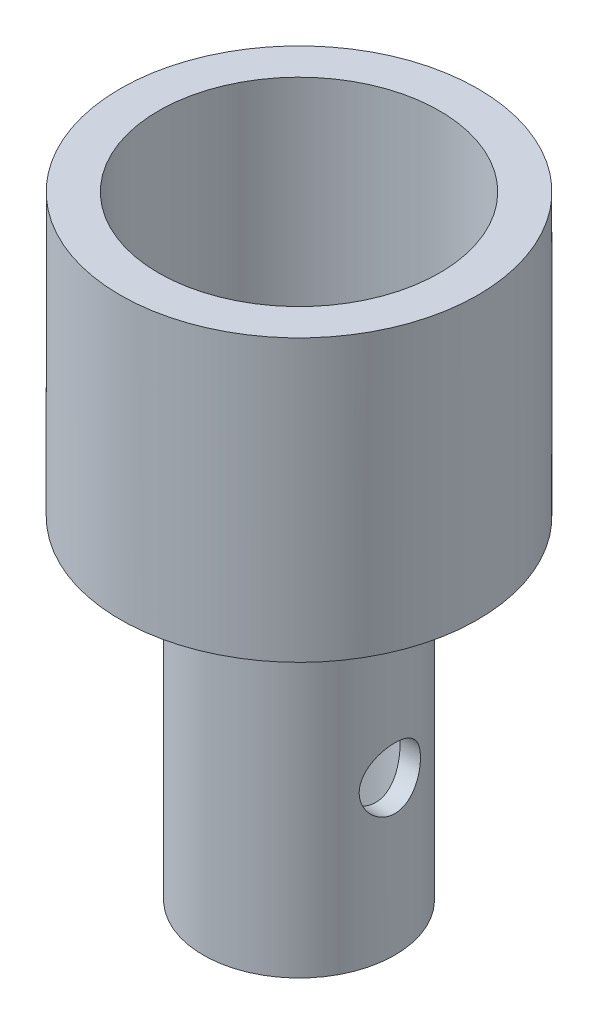
ISO-10303-21;
HEADER;
FILE_DESCRIPTION(('STEP AP214'),'2;1');
FILE_NAME('part.step','',(''),(''),'','','');
FILE_SCHEMA(('AUTOMOTIVE_DESIGN { 1 0 10303 214 1 1 1 1 }'));
ENDSEC;
DATA;
#1=APPLICATION_CONTEXT('core data for automotive mechanical design processes');
#2=APPLICATION_PROTOCOL_DEFINITION('international standard','automotive_design',2000,#1);
#3=PRODUCT_CONTEXT('',#1,'mechanical');
#4=PRODUCT('Part','Part','',(#3));
#5=PRODUCT_RELATED_PRODUCT_CATEGORY('part','',(#4));
#6=PRODUCT_DEFINITION_FORMATION('','',#4);
#7=PRODUCT_DEFINITION_CONTEXT('part definition',#1,'design');
#8=PRODUCT_DEFINITION('design','',#6,#7);
#9=PRODUCT_DEFINITION_SHAPE('','',#8);
#10=(LENGTH_UNIT() NAMED_UNIT(*) SI_UNIT(.MILLI.,.METRE.));
#11=(NAMED_UNIT(*) PLANE_ANGLE_UNIT() SI_UNIT($,.RADIAN.));
#12=(NAMED_UNIT(*) SI_UNIT($,.STERADIAN.) SOLID_ANGLE_UNIT());
#13=UNCERTAINTY_MEASURE_WITH_UNIT(LENGTH_MEASURE(1.E-05),#10,'distance_accuracy_value','');
#14=(GEOMETRIC_REPRESENTATION_CONTEXT(3) GLOBAL_UNCERTAINTY_ASSIGNED_CONTEXT((#13)) GLOBAL_UNIT_ASSIGNED_CONTEXT((#10,
#11,#12)) REPRESENTATION_CONTEXT('',''));
#15=CARTESIAN_POINT('',(0.,0.,0.));
#16=DIRECTION('',(0.,0.,1.));
#17=DIRECTION('',(1.,0.,0.));
#18=AXIS2_PLACEMENT_3D('',#15,#16,#17);
#19=CARTESIAN_POINT('',(0.,-47.625,0.));
#20=DIRECTION('',(0.,1.,0.));
#21=DIRECTION('',(0.,0.,1.));
#22=AXIS2_PLACEMENT_3D('',#19,#20,#21);
#23=CYLINDRICAL_SURFACE('',#22,9.525);
#24=CARTESIAN_POINT('',(8.72980669889088,-28.575,3.81));
#25=CARTESIAN_POINT('',(8.72980747738187,-28.6770865656871,3.80999921891842));
#26=CARTESIAN_POINT('',(8.7316035302612,-28.7792044364545,3.80589117768837));
#27=CARTESIAN_POINT('',(8.73872925778658,-28.9827005696976,3.7895003379036));
#28=CARTESIAN_POINT('',(8.7440610952037,-29.0840783410729,3.7772125359297));
#29=CARTESIAN_POINT('',(8.75809537381811,-29.2855039955711,3.74455713217612));
#30=CARTESIAN_POINT('',(8.76680453120531,-29.3855488153184,3.72417342879634));
#31=CARTESIAN_POINT('',(8.78730252503843,-29.5833999363233,3.67554450191171));
#32=CARTESIAN_POINT('',(8.79909263998481,-29.6812052899044,3.64729601444972));
#33=CARTESIAN_POINT('',(8.83844020491973,-29.9694502146137,3.55139604474048));
#34=CARTESIAN_POINT('',(8.87004966709332,-30.1557098697185,3.47242664764833));
#35=CARTESIAN_POINT('',(8.94044610819544,-30.512195708411,3.28691801772329));
#36=CARTESIAN_POINT('',(8.97923151940491,-30.6824253818114,3.18038480469522));
#37=CARTESIAN_POINT('',(9.06210097781532,-31.0119825024553,2.93622055267926));
#38=CARTESIAN_POINT('',(9.10635550256901,-31.1702866877078,2.79726326441719));
#39=CARTESIAN_POINT('',(9.19376744003837,-31.4620850386599,2.49499525834792));
#40=CARTESIAN_POINT('',(9.23692446483325,-31.5955705343691,2.33167606589396));
#41=CARTESIAN_POINT('',(9.31932488247285,-31.8390385346198,1.97740218795191));
#42=CARTESIAN_POINT('',(9.35834684996793,-31.9478867200209,1.78561172408189));
#43=CARTESIAN_POINT('',(9.42601483158086,-32.1313371719923,1.38460219550477));
#44=CARTESIAN_POINT('',(9.45466506684765,-32.2059533738102,1.17539026382774));
#45=CARTESIAN_POINT('',(9.49715508886746,-32.3151654882751,0.756221054229135));
#46=CARTESIAN_POINT('',(9.51164474489124,-32.3515240217382,0.546790219021058));
#47=CARTESIAN_POINT('',(9.52652991918456,-32.3888642767845,0.124332353087547));
#48=CARTESIAN_POINT('',(9.52693069423268,-32.3898591930799,-0.0886933066711253));
#49=CARTESIAN_POINT('',(9.5139883915877,-32.3574103207245,-0.499552901702398));
#50=CARTESIAN_POINT('',(9.50141603845793,-32.325897807152,-0.697568047529193));
#51=CARTESIAN_POINT('',(9.464979002526,-32.2326135713932,-1.08522727325679));
#52=CARTESIAN_POINT('',(9.44111349115204,-32.1708396289334,-1.27487073781632));
#53=CARTESIAN_POINT('',(9.3839695059041,-32.0180274999114,-1.64382057281083));
#54=CARTESIAN_POINT('',(9.3505545868787,-31.9265622932215,-1.82292807252289));
#55=CARTESIAN_POINT('',(9.27762784768709,-31.7173641618742,-2.16371452717611));
#56=CARTESIAN_POINT('',(9.23811393928998,-31.5996222341594,-2.32538748038155));
#57=CARTESIAN_POINT('',(9.15393718820429,-31.3322033960107,-2.63798461731719));
#58=CARTESIAN_POINT('',(9.10910662004878,-31.1809373346445,-2.78750619523124));
#59=CARTESIAN_POINT('',(9.02134964154089,-30.8553029606644,-3.05963462632409));
#60=CARTESIAN_POINT('',(8.97842385810392,-30.6809271161886,-3.1822326699145));
#61=CARTESIAN_POINT('',(8.89819589564183,-30.3077517623764,-3.4002424795099));
#62=CARTESIAN_POINT('',(8.86108681279932,-30.1084014982046,-3.494788511367));
#63=CARTESIAN_POINT('',(8.79895859605483,-29.6947294909555,-3.64841077504569));
#64=CARTESIAN_POINT('',(8.77393161182948,-29.4804175730959,-3.70751004441008));
#65=CARTESIAN_POINT('',(8.74070692233674,-29.0568968439245,-3.78514917756856));
#66=CARTESIAN_POINT('',(8.73157448098943,-28.8481761482201,-3.8059463444317));
#67=CARTESIAN_POINT('',(8.72850993440519,-28.4300729192181,-3.8129743268737));
#68=CARTESIAN_POINT('',(8.7345732196749,-28.2206906058599,-3.7992156246764));
#69=CARTESIAN_POINT('',(8.76025764504111,-27.8197457289071,-3.739577664575));
#70=CARTESIAN_POINT('',(8.77908692105765,-27.627847454253,-3.69557248315545));
#71=CARTESIAN_POINT('',(8.82719947207082,-27.2542855888836,-3.57912197606522));
#72=CARTESIAN_POINT('',(8.85648506490779,-27.0726242777304,-3.50667034434587));
#73=CARTESIAN_POINT('',(8.92366354443494,-26.7164775083997,-3.33210339321236));
#74=CARTESIAN_POINT('',(8.96185732337635,-26.5425818105387,-3.22890426404401));
#75=CARTESIAN_POINT('',(9.04208983725597,-26.213784908922,-2.99687975256181));
#76=CARTESIAN_POINT('',(9.08413013426956,-26.0588914823181,-2.86804393398354));
#77=CARTESIAN_POINT('',(9.17106844925558,-25.7606036566253,-2.57716822325093));
#78=CARTESIAN_POINT('',(9.21594817878408,-25.6189037431468,-2.41337864309133));
#79=CARTESIAN_POINT('',(9.3005870865111,-25.3647376690311,-2.06327432156922));
#80=CARTESIAN_POINT('',(9.3403460562478,-25.2522726983342,-1.87695866378718));
#81=CARTESIAN_POINT('',(9.41038978790385,-25.0601842716895,-1.48643327426745));
#82=CARTESIAN_POINT('',(9.44067681788991,-24.9805529522303,-1.28222784127166));
#83=CARTESIAN_POINT('',(9.48828519157729,-24.8572994357976,-0.861809790723142));
#84=CARTESIAN_POINT('',(9.50561357138139,-24.8136576963915,-0.645603757692744));
#85=CARTESIAN_POINT('',(9.52460010645449,-24.7659435446798,-0.222535452132904));
#86=CARTESIAN_POINT('',(9.52720688064992,-24.7594752598969,-0.0159838881118244));
#87=CARTESIAN_POINT('',(9.51901910715213,-24.7799646834187,0.395161456793925));
#88=CARTESIAN_POINT('',(9.5082265880737,-24.8069173318887,0.599755529312003));
#89=CARTESIAN_POINT('',(9.47492733016673,-24.8917716484877,0.994735569210881));
#90=CARTESIAN_POINT('',(9.45279060820881,-24.9486972035711,1.18536492654433));
#91=CARTESIAN_POINT('',(9.3991737540751,-25.0908555313818,1.55433208212594));
#92=CARTESIAN_POINT('',(9.3676918987177,-25.1760935250833,1.73266760599178));
#93=CARTESIAN_POINT('',(9.29674470583298,-25.3767018318089,2.08064680910122));
#94=CARTESIAN_POINT('',(9.25698805283235,-25.4932372507516,2.24955814157398));
#95=CARTESIAN_POINT('',(9.17427809917919,-25.7513862196634,2.56613786960793));
#96=CARTESIAN_POINT('',(9.13132347972609,-25.8930101493972,2.71379742675579));
#97=CARTESIAN_POINT('',(9.04375452093767,-26.2076891125197,2.99313862724399));
#98=CARTESIAN_POINT('',(8.99920205160159,-26.3821471645137,3.12326526431714));
#99=CARTESIAN_POINT('',(8.91634576107669,-26.7517909094884,3.35250855878604));
#100=CARTESIAN_POINT('',(8.87804267480121,-26.9469790358296,3.45162157030556));
#101=CARTESIAN_POINT('',(8.81555800361856,-27.33496305645,3.60805586195513));
#102=CARTESIAN_POINT('',(8.79041725048609,-27.5264000613384,3.66833057302889));
#103=CARTESIAN_POINT('',(8.76191001465829,-27.8193236092007,3.73565387079997));
#104=CARTESIAN_POINT('',(8.75394430278663,-27.9178445666894,3.75424114668035));
#105=CARTESIAN_POINT('',(8.74129443325385,-28.1162349754544,3.78360480272399));
#106=CARTESIAN_POINT('',(8.73660837091746,-28.2161036096496,3.79438571660285));
#107=CARTESIAN_POINT('',(8.73236450840805,-28.3593069382632,3.80413481078377));
#108=CARTESIAN_POINT('',(8.73140614474182,-28.4024068383819,3.80633343140281));
#109=CARTESIAN_POINT('',(8.730127052012,-28.4886692902144,3.80926624483991));
#110=CARTESIAN_POINT('',(8.72980636969948,-28.5318318462897,3.81000033028684));
#111=CARTESIAN_POINT('',(8.72980669889088,-28.575,3.81));
#112=B_SPLINE_CURVE_WITH_KNOTS('',3,(#24,#25,#26,#27,#28,#29,#30,#31,#32,#33,#34,#35,#36,#37,
#38,#39,#40,#41,#42,#43,#44,#45,#46,#47,#48,#49,#50,#51,#52,#53,#54,#55,#56,#57,#58,#59,#60,#61,
#62,#63,#64,#65,#66,#67,#68,#69,#70,#71,#72,#73,#74,#75,#76,#77,#78,#79,#80,#81,#82,#83,#84,#85,
#86,#87,#88,#89,#90,#91,#92,#93,#94,#95,#96,#97,#98,#99,#100,#101,#102,#103,#104,#105,#106,#107,
#108,#109,#110,#111),.UNSPECIFIED.,.T.,.F.,(4,2,2,2,2,2,2,2,2,2,2,2,2,2,2,2,2,2,2,2,2,2,2,2,2,2,
2,2,2,2,2,2,2,2,2,2,2,2,2,2,2,2,2,4),(0.,0.306215494379835,0.612618467843413,0.919633909654753,
1.22677695609031,1.83807904972284,2.44924775044349,3.09211265966723,3.73520172268486,
4.40364897754065,5.07182387711753,5.70765031534978,6.34323951442199,6.9431278153662,
7.54306013655752,8.15203425082374,8.76121733595653,9.41039617109876,10.0597871071207,
10.7275210699127,11.3948205877909,12.0213530416891,12.6476954653452,13.2383642073709,
13.8291639636626,14.4439226274829,15.0589320630664,15.7193692687539,16.3798333517938,
17.040139164658,17.7000861932752,18.3169759386998,18.933772300164,19.5316221254948,
20.1295822589835,20.7539664555645,21.378609581897,22.0419217564399,22.7053118788615,
23.3091355199523,23.6105627780589,23.9118148349693,24.0412911125356,24.1707768821949),.UNSPECIFIED.);
#113=CARTESIAN_POINT('',(8.72980669889088,-28.575,3.81));
#114=VERTEX_POINT('',#113);
#115=EDGE_CURVE('E61',#114,#114,#112,.T.);
#116=ORIENTED_EDGE('',*,*,#115,.T.);
#117=EDGE_LOOP('',(#116));
#118=FACE_BOUND('',#117,.T.);
#119=CARTESIAN_POINT('',(0.,-47.625,0.));
#120=DIRECTION('',(0.,-1.,0.));
#121=DIRECTION('',(0.,0.,-1.));
#122=AXIS2_PLACEMENT_3D('',#119,#120,#121);
#123=CIRCLE('',#122,9.525);
#124=CARTESIAN_POINT('',(0.,-47.625,-9.525));
#125=VERTEX_POINT('',#124);
#126=EDGE_CURVE('E60',#125,#125,#123,.T.);
#127=ORIENTED_EDGE('',*,*,#126,.T.);
#128=EDGE_LOOP('',(#127));
#129=FACE_BOUND('',#128,.T.);
#130=CARTESIAN_POINT('',(0.,0.,0.));
#131=DIRECTION('',(0.,-1.,0.));
#132=DIRECTION('',(0.,0.,-1.));
#133=AXIS2_PLACEMENT_3D('',#130,#131,#132);
#134=CIRCLE('',#133,9.525);
#135=CARTESIAN_POINT('',(0.,0.,-9.525));
#136=VERTEX_POINT('',#135);
#137=EDGE_CURVE('E67',#136,#136,#134,.T.);
#138=ORIENTED_EDGE('',*,*,#137,.F.);
#139=EDGE_LOOP('',(#138));
#140=FACE_BOUND('',#139,.T.);
#141=CARTESIAN_POINT('',(-8.72980669889088,-28.575,3.81));
#142=CARTESIAN_POINT('',(-8.72980747738187,-28.6770865656871,3.80999921891842));
#143=CARTESIAN_POINT('',(-8.7316035302612,-28.7792044364545,3.80589117768837));
#144=CARTESIAN_POINT('',(-8.73872925778658,-28.9827005696976,3.7895003379036));
#145=CARTESIAN_POINT('',(-8.7440610952037,-29.0840783410729,3.7772125359297));
#146=CARTESIAN_POINT('',(-8.75809537381811,-29.2855039955711,3.74455713217612));
#147=CARTESIAN_POINT('',(-8.76680453120531,-29.3855488153184,3.72417342879634));
#148=CARTESIAN_POINT('',(-8.78730252503843,-29.5833999363233,3.67554450191171));
#149=CARTESIAN_POINT('',(-8.79909263998481,-29.6812052899044,3.64729601444972));
#150=CARTESIAN_POINT('',(-8.83844020491973,-29.9694502146137,3.55139604474048));
#151=CARTESIAN_POINT('',(-8.87004966709332,-30.1557098697185,3.47242664764833));
#152=CARTESIAN_POINT('',(-8.94044610819544,-30.512195708411,3.28691801772329));
#153=CARTESIAN_POINT('',(-8.97923151940491,-30.6824253818114,3.18038480469522));
#154=CARTESIAN_POINT('',(-9.06210097781532,-31.0119825024553,2.93622055267926));
#155=CARTESIAN_POINT('',(-9.10635550256901,-31.1702866877078,2.79726326441719));
#156=CARTESIAN_POINT('',(-9.19376744003837,-31.4620850386599,2.49499525834792));
#157=CARTESIAN_POINT('',(-9.23692446483325,-31.5955705343691,2.33167606589396));
#158=CARTESIAN_POINT('',(-9.31932488247285,-31.8390385346198,1.97740218795191));
#159=CARTESIAN_POINT('',(-9.35834684996793,-31.9478867200209,1.78561172408189));
#160=CARTESIAN_POINT('',(-9.42601483158086,-32.1313371719923,1.38460219550477));
#161=CARTESIAN_POINT('',(-9.45466506684765,-32.2059533738102,1.17539026382774));
#162=CARTESIAN_POINT('',(-9.49715508886746,-32.3151654882751,0.756221054229135));
#163=CARTESIAN_POINT('',(-9.51164474489124,-32.3515240217382,0.546790219021058));
#164=CARTESIAN_POINT('',(-9.52652991918456,-32.3888642767845,0.124332353087547));
#165=CARTESIAN_POINT('',(-9.52693069423268,-32.3898591930799,-0.0886933066711253));
#166=CARTESIAN_POINT('',(-9.5139883915877,-32.3574103207245,-0.499552901702398));
#167=CARTESIAN_POINT('',(-9.50141603845793,-32.325897807152,-0.697568047529193));
#168=CARTESIAN_POINT('',(-9.464979002526,-32.2326135713932,-1.08522727325679));
#169=CARTESIAN_POINT('',(-9.44111349115204,-32.1708396289334,-1.27487073781632));
#170=CARTESIAN_POINT('',(-9.3839695059041,-32.0180274999114,-1.64382057281083));
#171=CARTESIAN_POINT('',(-9.3505545868787,-31.9265622932215,-1.82292807252289));
#172=CARTESIAN_POINT('',(-9.27762784768709,-31.7173641618742,-2.16371452717611));
#173=CARTESIAN_POINT('',(-9.23811393928998,-31.5996222341594,-2.32538748038155));
#174=CARTESIAN_POINT('',(-9.15393718820429,-31.3322033960107,-2.63798461731719));
#175=CARTESIAN_POINT('',(-9.10910662004878,-31.1809373346445,-2.78750619523124));
#176=CARTESIAN_POINT('',(-9.02134964154089,-30.8553029606644,-3.05963462632409));
#177=CARTESIAN_POINT('',(-8.97842385810392,-30.6809271161886,-3.1822326699145));
#178=CARTESIAN_POINT('',(-8.89819589564183,-30.3077517623764,-3.4002424795099));
#179=CARTESIAN_POINT('',(-8.86108681279932,-30.1084014982046,-3.494788511367));
#180=CARTESIAN_POINT('',(-8.79895859605483,-29.6947294909555,-3.64841077504569));
#181=CARTESIAN_POINT('',(-8.77393161182948,-29.4804175730959,-3.70751004441008));
#182=CARTESIAN_POINT('',(-8.74070692233674,-29.0568968439245,-3.78514917756856));
#183=CARTESIAN_POINT('',(-8.73157448098943,-28.8481761482201,-3.8059463444317));
#184=CARTESIAN_POINT('',(-8.72850993440519,-28.4300729192181,-3.8129743268737));
#185=CARTESIAN_POINT('',(-8.7345732196749,-28.2206906058599,-3.7992156246764));
#186=CARTESIAN_POINT('',(-8.76025764504111,-27.8197457289071,-3.739577664575));
#187=CARTESIAN_POINT('',(-8.77908692105765,-27.627847454253,-3.69557248315545));
#188=CARTESIAN_POINT('',(-8.82719947207082,-27.2542855888836,-3.57912197606522));
#189=CARTESIAN_POINT('',(-8.85648506490779,-27.0726242777304,-3.50667034434587));
#190=CARTESIAN_POINT('',(-8.92366354443494,-26.7164775083997,-3.33210339321236));
#191=CARTESIAN_POINT('',(-8.96185732337635,-26.5425818105387,-3.22890426404401));
#192=CARTESIAN_POINT('',(-9.04208983725597,-26.213784908922,-2.99687975256181));
#193=CARTESIAN_POINT('',(-9.08413013426956,-26.0588914823181,-2.86804393398354));
#194=CARTESIAN_POINT('',(-9.17106844925558,-25.7606036566253,-2.57716822325093));
#195=CARTESIAN_POINT('',(-9.21594817878408,-25.6189037431468,-2.41337864309133));
#196=CARTESIAN_POINT('',(-9.3005870865111,-25.3647376690311,-2.06327432156922));
#197=CARTESIAN_POINT('',(-9.3403460562478,-25.2522726983342,-1.87695866378718));
#198=CARTESIAN_POINT('',(-9.41038978790385,-25.0601842716895,-1.48643327426745));
#199=CARTESIAN_POINT('',(-9.44067681788991,-24.9805529522303,-1.28222784127166));
#200=CARTESIAN_POINT('',(-9.48828519157729,-24.8572994357976,-0.861809790723142));
#201=CARTESIAN_POINT('',(-9.50561357138139,-24.8136576963915,-0.645603757692744));
#202=CARTESIAN_POINT('',(-9.52460010645449,-24.7659435446798,-0.222535452132904));
#203=CARTESIAN_POINT('',(-9.52720688064992,-24.7594752598969,-0.0159838881118244));
#204=CARTESIAN_POINT('',(-9.51901910715213,-24.7799646834187,0.395161456793925));
#205=CARTESIAN_POINT('',(-9.5082265880737,-24.8069173318887,0.599755529312003));
#206=CARTESIAN_POINT('',(-9.47492733016673,-24.8917716484877,0.994735569210881));
#207=CARTESIAN_POINT('',(-9.45279060820881,-24.9486972035711,1.18536492654433));
#208=CARTESIAN_POINT('',(-9.3991737540751,-25.0908555313818,1.55433208212594));
#209=CARTESIAN_POINT('',(-9.3676918987177,-25.1760935250833,1.73266760599178));
#210=CARTESIAN_POINT('',(-9.29674470583298,-25.3767018318089,2.08064680910122));
#211=CARTESIAN_POINT('',(-9.25698805283235,-25.4932372507516,2.24955814157398));
#212=CARTESIAN_POINT('',(-9.17427809917919,-25.7513862196634,2.56613786960793));
#213=CARTESIAN_POINT('',(-9.13132347972609,-25.8930101493972,2.71379742675579));
#214=CARTESIAN_POINT('',(-9.04375452093767,-26.2076891125197,2.99313862724399));
#215=CARTESIAN_POINT('',(-8.99920205160159,-26.3821471645137,3.12326526431714));
#216=CARTESIAN_POINT('',(-8.91634576107669,-26.7517909094884,3.35250855878604));
#217=CARTESIAN_POINT('',(-8.87804267480121,-26.9469790358296,3.45162157030556));
#218=CARTESIAN_POINT('',(-8.81555800361856,-27.33496305645,3.60805586195513));
#219=CARTESIAN_POINT('',(-8.79041725048609,-27.5264000613384,3.66833057302889));
#220=CARTESIAN_POINT('',(-8.76191001465829,-27.8193236092007,3.73565387079997));
#221=CARTESIAN_POINT('',(-8.75394430278663,-27.9178445666894,3.75424114668035));
#222=CARTESIAN_POINT('',(-8.74129443325385,-28.1162349754544,3.78360480272399));
#223=CARTESIAN_POINT('',(-8.73660837091746,-28.2161036096496,3.79438571660285));
#224=CARTESIAN_POINT('',(-8.73236450840805,-28.3593069382632,3.80413481078377));
#225=CARTESIAN_POINT('',(-8.73140614474182,-28.4024068383819,3.80633343140281));
#226=CARTESIAN_POINT('',(-8.730127052012,-28.4886692902144,3.80926624483991));
#227=CARTESIAN_POINT('',(-8.72980636969948,-28.5318318462897,3.81000033028684));
#228=CARTESIAN_POINT('',(-8.72980669889088,-28.575,3.81));
#229=B_SPLINE_CURVE_WITH_KNOTS('',3,(#141,#142,#143,#144,#145,#146,#147,#148,#149,#150,#151,
#152,#153,#154,#155,#156,#157,#158,#159,#160,#161,#162,#163,#164,#165,#166,#167,#168,#169,#170,
#171,#172,#173,#174,#175,#176,#177,#178,#179,#180,#181,#182,#183,#184,#185,#186,#187,#188,#189,
#190,#191,#192,#193,#194,#195,#196,#197,#198,#199,#200,#201,#202,#203,#204,#205,#206,#207,#208,
#209,#210,#211,#212,#213,#214,#215,#216,#217,#218,#219,#220,#221,#222,#223,#224,#225,#226,#227,
#228),.UNSPECIFIED.,.T.,.F.,(4,2,2,2,2,2,2,2,2,2,2,2,2,2,2,2,2,2,2,2,2,2,2,2,2,2,2,2,2,2,2,2,2,
2,2,2,2,2,2,2,2,2,2,4),(0.,0.306215494379835,0.612618467843413,0.919633909654753,
1.22677695609031,1.83807904972284,2.44924775044349,3.09211265966723,3.73520172268486,
4.40364897754065,5.07182387711753,5.70765031534978,6.34323951442199,6.9431278153662,
7.54306013655752,8.15203425082374,8.76121733595653,9.41039617109876,10.0597871071207,
10.7275210699127,11.3948205877909,12.0213530416891,12.6476954653452,13.2383642073709,
13.8291639636626,14.4439226274829,15.0589320630664,15.7193692687539,16.3798333517938,
17.040139164658,17.7000861932752,18.3169759386998,18.933772300164,19.5316221254948,
20.1295822589835,20.7539664555645,21.378609581897,22.0419217564399,22.7053118788615,
23.3091355199523,23.6105627780589,23.9118148349693,24.0412911125356,24.1707768821949),.UNSPECIFIED.);
#230=CARTESIAN_POINT('',(-8.72980669889088,-28.575,3.81));
#231=VERTEX_POINT('',#230);
#232=EDGE_CURVE('E101',#231,#231,#229,.T.);
#233=ORIENTED_EDGE('',*,*,#232,.F.);
#234=EDGE_LOOP('',(#233));
#235=FACE_BOUND('',#234,.T.);
#236=ADVANCED_FACE('F37',(#118,#129,#140,#235),#23,.F.);
#237=CARTESIAN_POINT('',(0.,62.8617928474841,0.));
#238=DIRECTION('',(0.,-1.,0.));
#239=DIRECTION('',(0.,0.,-1.));
#240=AXIS2_PLACEMENT_3D('',#237,#238,#239);
#241=CYLINDRICAL_SURFACE('',#240,11.90625);
#242=CARTESIAN_POINT('',(0.,-47.625,0.));
#243=DIRECTION('',(0.,-1.,0.));
#244=DIRECTION('',(0.,0.,-1.));
#245=AXIS2_PLACEMENT_3D('',#242,#243,#244);
#246=CIRCLE('',#245,11.90625);
#247=CARTESIAN_POINT('',(0.,-47.625,-11.90625));
#248=VERTEX_POINT('',#247);
#249=EDGE_CURVE('E105',#248,#248,#246,.T.);
#250=ORIENTED_EDGE('',*,*,#249,.F.);
#251=EDGE_LOOP('',(#250));
#252=FACE_BOUND('',#251,.T.);
#253=CARTESIAN_POINT('',(0.,-6.34999999999999,0.));
#254=DIRECTION('',(0.,-1.,0.));
#255=DIRECTION('',(0.,0.,-1.));
#256=AXIS2_PLACEMENT_3D('',#253,#254,#255);
#257=CIRCLE('',#256,11.90625);
#258=CARTESIAN_POINT('',(0.,-6.34999999999999,-11.90625));
#259=VERTEX_POINT('',#258);
#260=EDGE_CURVE('E100',#259,#259,#257,.F.);
#261=ORIENTED_EDGE('',*,*,#260,.F.);
#262=EDGE_LOOP('',(#261));
#263=FACE_BOUND('',#262,.T.);
#264=CARTESIAN_POINT('',(11.2801901164165,-28.575,3.81));
#265=CARTESIAN_POINT('',(11.2801907713837,-28.7830408542117,3.80999938978375));
#266=CARTESIAN_POINT('',(11.2860084223011,-28.9910889183156,3.79290246227797));
#267=CARTESIAN_POINT('',(11.308541293333,-29.4010546430205,3.72517437841876));
#268=CARTESIAN_POINT('',(11.3252590416891,-29.6029708699878,3.67453544206372));
#269=CARTESIAN_POINT('',(11.3675088910845,-29.9946729170321,3.5416574585783));
#270=CARTESIAN_POINT('',(11.3930247994879,-30.1844802677505,3.45947643209969));
#271=CARTESIAN_POINT('',(11.449973104657,-30.5476695076837,3.26604235794547));
#272=CARTESIAN_POINT('',(11.4814066410428,-30.7210482233779,3.15478370887961));
#273=CARTESIAN_POINT('',(11.547918756211,-31.0527058534074,2.90205894900935));
#274=CARTESIAN_POINT('',(11.5830828956024,-31.2103059565368,2.75972432074192));
#275=CARTESIAN_POINT('',(11.6523677975874,-31.4998570515884,2.45074469129871));
#276=CARTESIAN_POINT('',(11.6864884063885,-31.6318042780691,2.28409612749165));
#277=CARTESIAN_POINT('',(11.75082469535,-31.8693293237456,1.92631081223948));
#278=CARTESIAN_POINT('',(11.7809279353835,-31.9742037742927,1.73468511296899));
#279=CARTESIAN_POINT('',(11.8328353634951,-32.1499672054432,1.33538641079223));
#280=CARTESIAN_POINT('',(11.8546416022912,-32.2208645850724,1.12771738849967));
#281=CARTESIAN_POINT('',(11.886892295236,-32.3243823742875,0.709337965971049));
#282=CARTESIAN_POINT('',(11.8976806192989,-32.3581639260567,0.49894185725667));
#283=CARTESIAN_POINT('',(11.9078965895931,-32.3901747074745,0.0752097093731688));
#284=CARTESIAN_POINT('',(11.9073269400682,-32.3884123998343,-0.138125617903466));
#285=CARTESIAN_POINT('',(11.8951283240496,-32.3501396859283,-0.553491777031935));
#286=CARTESIAN_POINT('',(11.8839002575346,-32.3148888613921,-0.75565234069774));
#287=CARTESIAN_POINT('',(11.8521430939953,-32.212712220907,-1.15102074925322));
#288=CARTESIAN_POINT('',(11.831613381036,-32.1457843073566,-1.34422800033985));
#289=CARTESIAN_POINT('',(11.7830313139218,-31.9813704275672,-1.71905759252031));
#290=CARTESIAN_POINT('',(11.7548875899221,-31.8835106988312,-1.90050365677326));
#291=CARTESIAN_POINT('',(11.6940302239583,-31.6603136948219,-2.24478398533578));
#292=CARTESIAN_POINT('',(11.6613153850602,-31.5349692178322,-2.40761335454388));
#293=CARTESIAN_POINT('',(11.593102984835,-31.2539356781264,-2.71754328198413));
#294=CARTESIAN_POINT('',(11.5575462859818,-31.0971619854827,-2.86364871563205));
#295=CARTESIAN_POINT('',(11.4888784054941,-30.7610154535289,-3.12780062522132));
#296=CARTESIAN_POINT('',(11.4557675422045,-30.5816396805709,-3.24584345301152));
#297=CARTESIAN_POINT('',(11.3954327596139,-30.2024492622169,-3.45175342433642));
#298=CARTESIAN_POINT('',(11.368285757162,-30.0024115581814,-3.53923402599173));
#299=CARTESIAN_POINT('',(11.3238498616603,-29.5893629549534,-3.67894699538996));
#300=CARTESIAN_POINT('',(11.3065572215543,-29.3763570209912,-3.73119276233461));
#301=CARTESIAN_POINT('',(11.2846254446411,-28.9529903140599,-3.79699583164028));
#302=CARTESIAN_POINT('',(11.2794860538154,-28.7428932499172,-3.81208377840346));
#303=CARTESIAN_POINT('',(11.2810504020167,-28.3231488307895,-3.80745367953243));
#304=CARTESIAN_POINT('',(11.2877522007183,-28.1135014077612,-3.7877413363572));
#305=CARTESIAN_POINT('',(11.3117481761892,-27.7073272036354,-3.71544088027257));
#306=CARTESIAN_POINT('',(11.3287098282462,-27.5105951881732,-3.66388379898133));
#307=CARTESIAN_POINT('',(11.3709572653769,-27.1286021758695,-3.53057727390665));
#308=CARTESIAN_POINT('',(11.3962444508822,-26.9433431151178,-3.44882275035266));
#309=CARTESIAN_POINT('',(11.4532277213546,-26.5834466889459,-3.25466769701989));
#310=CARTESIAN_POINT('',(11.4850922283964,-26.4092898943353,-3.14142708063189));
#311=CARTESIAN_POINT('',(11.5512989541129,-26.0818945384249,-2.88848481941069));
#312=CARTESIAN_POINT('',(11.5856418457873,-25.9286616918927,-2.74877597032476));
#313=CARTESIAN_POINT('',(11.6547545794491,-25.6405401178023,-2.43959295397962));
#314=CARTESIAN_POINT('',(11.6894773093447,-25.5067479412288,-2.26908357973566));
#315=CARTESIAN_POINT('',(11.7539420479145,-25.2696224097348,-1.90718809463542));
#316=CARTESIAN_POINT('',(11.7836842692113,-25.1662877544107,-1.71580287556508));
#317=CARTESIAN_POINT('',(11.8346765106693,-24.9939905315063,-1.31869758065327));
#318=CARTESIAN_POINT('',(11.8559860068543,-24.9247863555272,-1.11309037023182));
#319=CARTESIAN_POINT('',(11.8879721122896,-24.8221878520863,-0.692348396602512));
#320=CARTESIAN_POINT('',(11.8986522275102,-24.7887817168028,-0.477216799366498));
#321=CARTESIAN_POINT('',(11.9079324131159,-24.7597238455637,-0.0536034499807127));
#322=CARTESIAN_POINT('',(11.9070381439575,-24.7624917935851,0.154760067577385));
#323=CARTESIAN_POINT('',(11.8944931876559,-24.8018548081282,0.567917261523855));
#324=CARTESIAN_POINT('',(11.882843260673,-24.8384474840746,0.772711189152183));
#325=CARTESIAN_POINT('',(11.8502652446312,-24.9433991322614,1.17015349279156));
#326=CARTESIAN_POINT('',(11.829466057955,-25.0113173868862,1.36292955578984));
#327=CARTESIAN_POINT('',(11.7807325020907,-25.176590989044,1.7344371039793));
#328=CARTESIAN_POINT('',(11.7527968823823,-25.2739514963062,1.91316612051519));
#329=CARTESIAN_POINT('',(11.691474446828,-25.499284887914,2.25832477115892));
#330=CARTESIAN_POINT('',(11.6579309291843,-25.6282108312118,2.42410405306973));
#331=CARTESIAN_POINT('',(11.5896005188201,-25.9113558380949,2.73219673858007));
#332=CARTESIAN_POINT('',(11.5548132479083,-26.0655826470216,2.87450292953646));
#333=CARTESIAN_POINT('',(11.4864721175774,-26.4014584499211,3.13668242972551));
#334=CARTESIAN_POINT('',(11.4530048853998,-26.5838820986826,3.25558882388913));
#335=CARTESIAN_POINT('',(11.3926374213726,-26.9671435803836,3.46094181799192));
#336=CARTESIAN_POINT('',(11.3657348566329,-27.1679748367955,3.54739995498383));
#337=CARTESIAN_POINT('',(11.3234597386517,-27.5676903903892,3.68002200207636));
#338=CARTESIAN_POINT('',(11.3074031009805,-27.7656968399529,3.72861485333093));
#339=CARTESIAN_POINT('',(11.2857694278991,-28.1674676334378,3.79359966863491));
#340=CARTESIAN_POINT('',(11.2801894748962,-28.371230358277,3.81000059768812));
#341=CARTESIAN_POINT('',(11.2801901164165,-28.575,3.81));
#342=B_SPLINE_CURVE_WITH_KNOTS('',3,(#264,#265,#266,#267,#268,#269,#270,#271,#272,#273,#274,
#275,#276,#277,#278,#279,#280,#281,#282,#283,#284,#285,#286,#287,#288,#289,#290,#291,#292,#293,
#294,#295,#296,#297,#298,#299,#300,#301,#302,#303,#304,#305,#306,#307,#308,#309,#310,#311,#312,
#313,#314,#315,#316,#317,#318,#319,#320,#321,#322,#323,#324,#325,#326,#327,#328,#329,#330,#331,
#332,#333,#334,#335,#336,#337,#338,#339,#340,#341),.UNSPECIFIED.,.T.,.F.,(4,2,2,2,2,2,2,2,2,2,2,
2,2,2,2,2,2,2,2,2,2,2,2,2,2,2,2,2,2,2,2,2,2,2,2,2,2,2,4),(0.,0.623369190186373,1.24688302026028,
1.86925537151177,2.49174770242344,3.13458742247902,3.77752143024192,4.43577767650616,
5.09387111984355,5.73073230961601,6.36744186957859,6.98111365877959,7.59482608994043,
8.21625761993107,8.83785217608153,9.48654443947136,10.135320987083,10.7920288783218,
11.4484868938099,12.0774140436849,12.7062381456137,13.3156989292734,13.9252622822806,
14.5529773065997,15.1808634315632,15.8362333863335,16.491575355602,17.1422091009296,
17.7926281715409,18.414731382858,19.0367906301587,19.6503532700258,20.264023498587,
20.8991952008699,21.5345617120451,22.1923118116296,22.8498278245925,23.4605689516109,
24.071139971552),.UNSPECIFIED.);
#343=CARTESIAN_POINT('',(11.2801901164165,-28.575,3.81));
#344=VERTEX_POINT('',#343);
#345=EDGE_CURVE('E41',#344,#344,#342,.T.);
#346=ORIENTED_EDGE('',*,*,#345,.F.);
#347=EDGE_LOOP('',(#346));
#348=FACE_BOUND('',#347,.T.);
#349=CARTESIAN_POINT('',(-11.2801901164165,-28.575,3.81));
#350=CARTESIAN_POINT('',(-11.2801907713837,-28.7830408542117,3.80999938978375));
#351=CARTESIAN_POINT('',(-11.2860084223011,-28.9910889183156,3.79290246227797));
#352=CARTESIAN_POINT('',(-11.308541293333,-29.4010546430205,3.72517437841876));
#353=CARTESIAN_POINT('',(-11.3252590416891,-29.6029708699878,3.67453544206372));
#354=CARTESIAN_POINT('',(-11.3675088910845,-29.9946729170321,3.5416574585783));
#355=CARTESIAN_POINT('',(-11.3930247994879,-30.1844802677505,3.45947643209969));
#356=CARTESIAN_POINT('',(-11.449973104657,-30.5476695076837,3.26604235794547));
#357=CARTESIAN_POINT('',(-11.4814066410428,-30.7210482233779,3.15478370887961));
#358=CARTESIAN_POINT('',(-11.547918756211,-31.0527058534074,2.90205894900935));
#359=CARTESIAN_POINT('',(-11.5830828956024,-31.2103059565368,2.75972432074192));
#360=CARTESIAN_POINT('',(-11.6523677975874,-31.4998570515884,2.45074469129871));
#361=CARTESIAN_POINT('',(-11.6864884063885,-31.6318042780691,2.28409612749165));
#362=CARTESIAN_POINT('',(-11.75082469535,-31.8693293237456,1.92631081223948));
#363=CARTESIAN_POINT('',(-11.7809279353835,-31.9742037742927,1.73468511296899));
#364=CARTESIAN_POINT('',(-11.8328353634951,-32.1499672054432,1.33538641079223));
#365=CARTESIAN_POINT('',(-11.8546416022912,-32.2208645850724,1.12771738849967));
#366=CARTESIAN_POINT('',(-11.886892295236,-32.3243823742875,0.709337965971049));
#367=CARTESIAN_POINT('',(-11.8976806192989,-32.3581639260567,0.49894185725667));
#368=CARTESIAN_POINT('',(-11.9078965895931,-32.3901747074745,0.0752097093731688));
#369=CARTESIAN_POINT('',(-11.9073269400682,-32.3884123998343,-0.138125617903466));
#370=CARTESIAN_POINT('',(-11.8951283240496,-32.3501396859283,-0.553491777031935));
#371=CARTESIAN_POINT('',(-11.8839002575346,-32.3148888613921,-0.75565234069774));
#372=CARTESIAN_POINT('',(-11.8521430939953,-32.212712220907,-1.15102074925322));
#373=CARTESIAN_POINT('',(-11.831613381036,-32.1457843073566,-1.34422800033985));
#374=CARTESIAN_POINT('',(-11.7830313139218,-31.9813704275672,-1.71905759252031));
#375=CARTESIAN_POINT('',(-11.7548875899221,-31.8835106988312,-1.90050365677326));
#376=CARTESIAN_POINT('',(-11.6940302239583,-31.6603136948219,-2.24478398533578));
#377=CARTESIAN_POINT('',(-11.6613153850602,-31.5349692178322,-2.40761335454388));
#378=CARTESIAN_POINT('',(-11.593102984835,-31.2539356781264,-2.71754328198413));
#379=CARTESIAN_POINT('',(-11.5575462859818,-31.0971619854827,-2.86364871563205));
#380=CARTESIAN_POINT('',(-11.4888784054941,-30.7610154535289,-3.12780062522132));
#381=CARTESIAN_POINT('',(-11.4557675422045,-30.5816396805709,-3.24584345301152));
#382=CARTESIAN_POINT('',(-11.3954327596139,-30.2024492622169,-3.45175342433642));
#383=CARTESIAN_POINT('',(-11.368285757162,-30.0024115581814,-3.53923402599173));
#384=CARTESIAN_POINT('',(-11.3238498616603,-29.5893629549534,-3.67894699538996));
#385=CARTESIAN_POINT('',(-11.3065572215543,-29.3763570209912,-3.73119276233461));
#386=CARTESIAN_POINT('',(-11.2846254446411,-28.9529903140599,-3.79699583164028));
#387=CARTESIAN_POINT('',(-11.2794860538154,-28.7428932499172,-3.81208377840346));
#388=CARTESIAN_POINT('',(-11.2810504020167,-28.3231488307895,-3.80745367953243));
#389=CARTESIAN_POINT('',(-11.2877522007183,-28.1135014077612,-3.7877413363572));
#390=CARTESIAN_POINT('',(-11.3117481761892,-27.7073272036354,-3.71544088027257));
#391=CARTESIAN_POINT('',(-11.3287098282462,-27.5105951881732,-3.66388379898133));
#392=CARTESIAN_POINT('',(-11.3709572653769,-27.1286021758695,-3.53057727390665));
#393=CARTESIAN_POINT('',(-11.3962444508822,-26.9433431151178,-3.44882275035266));
#394=CARTESIAN_POINT('',(-11.4532277213546,-26.5834466889459,-3.25466769701989));
#395=CARTESIAN_POINT('',(-11.4850922283964,-26.4092898943353,-3.14142708063189));
#396=CARTESIAN_POINT('',(-11.5512989541129,-26.0818945384249,-2.88848481941069));
#397=CARTESIAN_POINT('',(-11.5856418457873,-25.9286616918927,-2.74877597032476));
#398=CARTESIAN_POINT('',(-11.6547545794491,-25.6405401178023,-2.43959295397962));
#399=CARTESIAN_POINT('',(-11.6894773093447,-25.5067479412288,-2.26908357973566));
#400=CARTESIAN_POINT('',(-11.7539420479145,-25.2696224097348,-1.90718809463542));
#401=CARTESIAN_POINT('',(-11.7836842692113,-25.1662877544107,-1.71580287556508));
#402=CARTESIAN_POINT('',(-11.8346765106693,-24.9939905315063,-1.31869758065327));
#403=CARTESIAN_POINT('',(-11.8559860068543,-24.9247863555272,-1.11309037023182));
#404=CARTESIAN_POINT('',(-11.8879721122896,-24.8221878520863,-0.692348396602512));
#405=CARTESIAN_POINT('',(-11.8986522275102,-24.7887817168028,-0.477216799366498));
#406=CARTESIAN_POINT('',(-11.9079324131159,-24.7597238455637,-0.0536034499807127));
#407=CARTESIAN_POINT('',(-11.9070381439575,-24.7624917935851,0.154760067577385));
#408=CARTESIAN_POINT('',(-11.8944931876559,-24.8018548081282,0.567917261523855));
#409=CARTESIAN_POINT('',(-11.882843260673,-24.8384474840746,0.772711189152183));
#410=CARTESIAN_POINT('',(-11.8502652446312,-24.9433991322614,1.17015349279156));
#411=CARTESIAN_POINT('',(-11.829466057955,-25.0113173868862,1.36292955578984));
#412=CARTESIAN_POINT('',(-11.7807325020907,-25.176590989044,1.7344371039793));
#413=CARTESIAN_POINT('',(-11.7527968823823,-25.2739514963062,1.91316612051519));
#414=CARTESIAN_POINT('',(-11.691474446828,-25.499284887914,2.25832477115892));
#415=CARTESIAN_POINT('',(-11.6579309291843,-25.6282108312118,2.42410405306973));
#416=CARTESIAN_POINT('',(-11.5896005188201,-25.9113558380949,2.73219673858007));
#417=CARTESIAN_POINT('',(-11.5548132479083,-26.0655826470216,2.87450292953646));
#418=CARTESIAN_POINT('',(-11.4864721175774,-26.4014584499211,3.13668242972551));
#419=CARTESIAN_POINT('',(-11.4530048853998,-26.5838820986826,3.25558882388913));
#420=CARTESIAN_POINT('',(-11.3926374213726,-26.9671435803836,3.46094181799192));
#421=CARTESIAN_POINT('',(-11.3657348566329,-27.1679748367955,3.54739995498383));
#422=CARTESIAN_POINT('',(-11.3234597386517,-27.5676903903892,3.68002200207636));
#423=CARTESIAN_POINT('',(-11.3074031009805,-27.7656968399529,3.72861485333093));
#424=CARTESIAN_POINT('',(-11.2857694278991,-28.1674676334378,3.79359966863491));
#425=CARTESIAN_POINT('',(-11.2801894748962,-28.371230358277,3.81000059768812));
#426=CARTESIAN_POINT('',(-11.2801901164165,-28.575,3.81));
#427=B_SPLINE_CURVE_WITH_KNOTS('',3,(#349,#350,#351,#352,#353,#354,#355,#356,#357,#358,#359,
#360,#361,#362,#363,#364,#365,#366,#367,#368,#369,#370,#371,#372,#373,#374,#375,#376,#377,#378,
#379,#380,#381,#382,#383,#384,#385,#386,#387,#388,#389,#390,#391,#392,#393,#394,#395,#396,#397,
#398,#399,#400,#401,#402,#403,#404,#405,#406,#407,#408,#409,#410,#411,#412,#413,#414,#415,#416,
#417,#418,#419,#420,#421,#422,#423,#424,#425,#426),.UNSPECIFIED.,.T.,.F.,(4,2,2,2,2,2,2,2,2,2,2,
2,2,2,2,2,2,2,2,2,2,2,2,2,2,2,2,2,2,2,2,2,2,2,2,2,2,2,4),(0.,0.623369190186373,1.24688302026028,
1.86925537151177,2.49174770242344,3.13458742247902,3.77752143024192,4.43577767650616,
5.09387111984355,5.73073230961601,6.36744186957859,6.98111365877959,7.59482608994043,
8.21625761993107,8.83785217608153,9.48654443947136,10.135320987083,10.7920288783218,
11.4484868938099,12.0774140436849,12.7062381456137,13.3156989292734,13.9252622822806,
14.5529773065997,15.1808634315632,15.8362333863335,16.491575355602,17.1422091009296,
17.7926281715409,18.414731382858,19.0367906301587,19.6503532700258,20.264023498587,
20.8991952008699,21.5345617120451,22.1923118116296,22.8498278245925,23.4605689516109,
24.071139971552),.UNSPECIFIED.);
#428=CARTESIAN_POINT('',(-11.2801901164165,-28.575,3.81));
#429=VERTEX_POINT('',#428);
#430=EDGE_CURVE('E93',#429,#429,#427,.T.);
#431=ORIENTED_EDGE('',*,*,#430,.T.);
#432=EDGE_LOOP('',(#431));
#433=FACE_BOUND('',#432,.T.);
#434=ADVANCED_FACE('F82',(#252,#263,#348,#433),#241,.T.);
#435=CARTESIAN_POINT('',(0.,28.575,0.));
#436=DIRECTION('',(0.,-1.,0.));
#437=DIRECTION('',(0.,0.,-1.));
#438=AXIS2_PLACEMENT_3D('',#435,#436,#437);
#439=CYLINDRICAL_SURFACE('',#438,22.225);
#440=CARTESIAN_POINT('',(0.,28.575,0.));
#441=DIRECTION('',(0.,1.,0.));
#442=DIRECTION('',(0.,0.,1.));
#443=AXIS2_PLACEMENT_3D('',#440,#441,#442);
#444=CIRCLE('',#443,22.225);
#445=CARTESIAN_POINT('',(0.,28.575,22.225));
#446=VERTEX_POINT('',#445);
#447=EDGE_CURVE('E11',#446,#446,#444,.T.);
#448=ORIENTED_EDGE('',*,*,#447,.F.);
#449=EDGE_LOOP('',(#448));
#450=FACE_BOUND('',#449,.T.);
#451=CARTESIAN_POINT('',(0.,-6.34999999999999,0.));
#452=DIRECTION('',(0.,-1.,0.));
#453=DIRECTION('',(0.,0.,-1.));
#454=AXIS2_PLACEMENT_3D('',#451,#452,#453);
#455=CIRCLE('',#454,22.225);
#456=CARTESIAN_POINT('',(0.,-6.34999999999999,-22.225));
#457=VERTEX_POINT('',#456);
#458=EDGE_CURVE('E131',#457,#457,#455,.F.);
#459=ORIENTED_EDGE('',*,*,#458,.T.);
#460=EDGE_LOOP('',(#459));
#461=FACE_BOUND('',#460,.T.);
#462=ADVANCED_FACE('F86',(#450,#461),#439,.T.);
#463=CARTESIAN_POINT('',(0.,-47.625,0.));
#464=DIRECTION('',(0.,-1.,0.));
#465=DIRECTION('',(0.,0.,-1.));
#466=AXIS2_PLACEMENT_3D('',#463,#464,#465);
#467=PLANE('',#466);
#468=ORIENTED_EDGE('',*,*,#126,.F.);
#469=EDGE_LOOP('',(#468));
#470=FACE_BOUND('',#469,.T.);
#471=ORIENTED_EDGE('',*,*,#249,.T.);
#472=EDGE_LOOP('',(#471));
#473=FACE_BOUND('',#472,.T.);
#474=ADVANCED_FACE('F74',(#470,#473),#467,.T.);
#475=CARTESIAN_POINT('',(22.225,-28.575,0.));
#476=DIRECTION('',(-1.,0.,0.));
#477=DIRECTION('',(0.,0.,1.));
#478=AXIS2_PLACEMENT_3D('',#475,#476,#477);
#479=CYLINDRICAL_SURFACE('',#478,3.81);
#480=ORIENTED_EDGE('',*,*,#115,.F.);
#481=EDGE_LOOP('',(#480));
#482=FACE_BOUND('',#481,.T.);
#483=ORIENTED_EDGE('',*,*,#345,.T.);
#484=EDGE_LOOP('',(#483));
#485=FACE_BOUND('',#484,.T.);
#486=ADVANCED_FACE('F70',(#482,#485),#479,.F.);
#487=CARTESIAN_POINT('',(0.,28.575,0.));
#488=DIRECTION('',(0.,-1.,0.));
#489=DIRECTION('',(0.,0.,-1.));
#490=AXIS2_PLACEMENT_3D('',#487,#488,#489);
#491=CYLINDRICAL_SURFACE('',#490,17.4625);
#492=CARTESIAN_POINT('',(0.,28.575,0.));
#493=DIRECTION('',(0.,1.,0.));
#494=DIRECTION('',(0.,0.,1.));
#495=AXIS2_PLACEMENT_3D('',#492,#493,#494);
#496=CIRCLE('',#495,17.4625);
#497=CARTESIAN_POINT('',(0.,28.575,17.4625));
#498=VERTEX_POINT('',#497);
#499=EDGE_CURVE('E50',#498,#498,#496,.T.);
#500=ORIENTED_EDGE('',*,*,#499,.T.);
#501=EDGE_LOOP('',(#500));
#502=FACE_BOUND('',#501,.T.);
#503=CARTESIAN_POINT('',(0.,0.,0.));
#504=DIRECTION('',(0.,1.,0.));
#505=DIRECTION('',(0.,0.,1.));
#506=AXIS2_PLACEMENT_3D('',#503,#504,#505);
#507=CIRCLE('',#506,17.4625);
#508=CARTESIAN_POINT('',(0.,0.,17.4625));
#509=VERTEX_POINT('',#508);
#510=EDGE_CURVE('E55',#509,#509,#507,.T.);
#511=ORIENTED_EDGE('',*,*,#510,.F.);
#512=EDGE_LOOP('',(#511));
#513=FACE_BOUND('',#512,.T.);
#514=ADVANCED_FACE('F39',(#502,#513),#491,.F.);
#515=CARTESIAN_POINT('',(0.,28.575,0.));
#516=DIRECTION('',(0.,1.,0.));
#517=DIRECTION('',(0.,0.,1.));
#518=AXIS2_PLACEMENT_3D('',#515,#516,#517);
#519=PLANE('',#518);
#520=ORIENTED_EDGE('',*,*,#499,.F.);
#521=EDGE_LOOP('',(#520));
#522=FACE_BOUND('',#521,.T.);
#523=ORIENTED_EDGE('',*,*,#447,.T.);
#524=EDGE_LOOP('',(#523));
#525=FACE_BOUND('',#524,.T.);
#526=ADVANCED_FACE('F155',(#522,#525),#519,.T.);
#527=CARTESIAN_POINT('',(0.,0.,0.));
#528=DIRECTION('',(0.,-1.,0.));
#529=DIRECTION('',(0.,0.,-1.));
#530=AXIS2_PLACEMENT_3D('',#527,#528,#529);
#531=PLANE('',#530);
#532=ORIENTED_EDGE('',*,*,#137,.T.);
#533=EDGE_LOOP('',(#532));
#534=FACE_BOUND('',#533,.T.);
#535=ORIENTED_EDGE('',*,*,#510,.T.);
#536=EDGE_LOOP('',(#535));
#537=FACE_BOUND('',#536,.T.);
#538=ADVANCED_FACE('F80',(#534,#537),#531,.F.);
#539=CARTESIAN_POINT('',(0.,-6.35,0.));
#540=DIRECTION('',(0.,-1.,0.));
#541=DIRECTION('',(0.,0.,-1.));
#542=AXIS2_PLACEMENT_3D('',#539,#540,#541);
#543=PLANE('',#542);
#544=ORIENTED_EDGE('',*,*,#458,.F.);
#545=EDGE_LOOP('',(#544));
#546=FACE_BOUND('',#545,.T.);
#547=ORIENTED_EDGE('',*,*,#260,.T.);
#548=EDGE_LOOP('',(#547));
#549=FACE_BOUND('',#548,.T.);
#550=ADVANCED_FACE('F76',(#546,#549),#543,.T.);
#551=CARTESIAN_POINT('',(-22.225,-28.575,0.));
#552=DIRECTION('',(1.,0.,0.));
#553=DIRECTION('',(0.,0.,1.));
#554=AXIS2_PLACEMENT_3D('',#551,#552,#553);
#555=CYLINDRICAL_SURFACE('',#554,3.81);
#556=ORIENTED_EDGE('',*,*,#232,.T.);
#557=EDGE_LOOP('',(#556));
#558=FACE_BOUND('',#557,.T.);
#559=ORIENTED_EDGE('',*,*,#430,.F.);
#560=EDGE_LOOP('',(#559));
#561=FACE_BOUND('',#560,.T.);
#562=ADVANCED_FACE('F79',(#558,#561),#555,.F.);
#563=CLOSED_SHELL('',(#236,#434,#462,#474,#486,#514,#526,#538,#550,#562));
#564=MANIFOLD_SOLID_BREP('B2',#563);
#565=ADVANCED_BREP_SHAPE_REPRESENTATION('',(#18,#564),#14);
#566=SHAPE_DEFINITION_REPRESENTATION(#9,#565);
ENDSEC;
END-ISO-10303-21;
